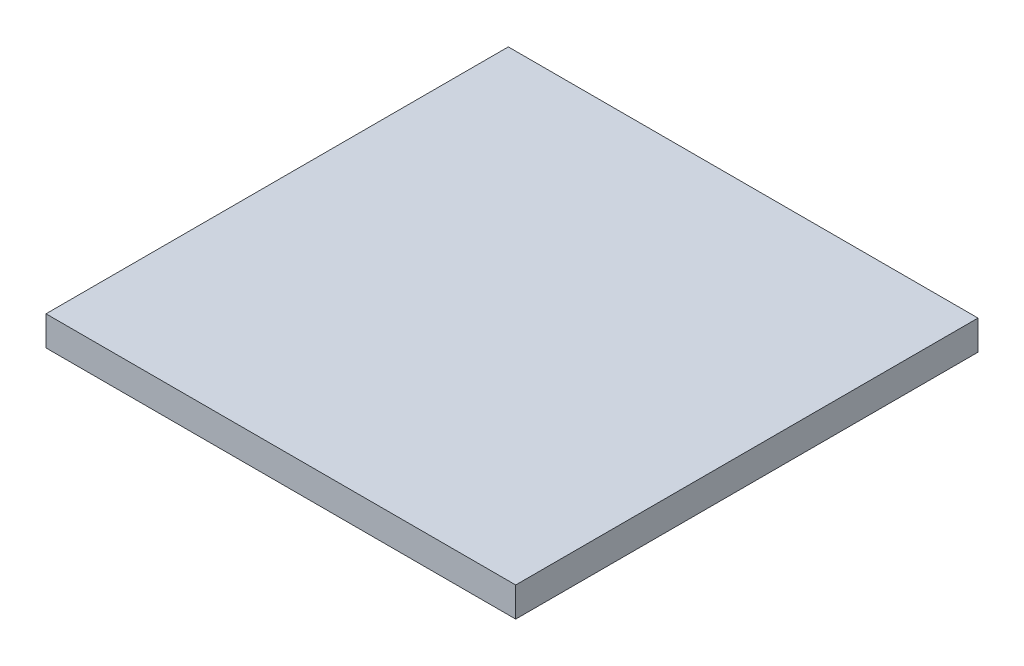
ISO-10303-21;
HEADER;
FILE_DESCRIPTION(('STEP AP214'),'2;1');
FILE_NAME('part.step','',(''),(''),'','','');
FILE_SCHEMA(('AUTOMOTIVE_DESIGN { 1 0 10303 214 1 1 1 1 }'));
ENDSEC;
DATA;
#1=APPLICATION_CONTEXT('core data for automotive mechanical design processes');
#2=APPLICATION_PROTOCOL_DEFINITION('international standard','automotive_design',2000,#1);
#3=PRODUCT_CONTEXT('',#1,'mechanical');
#4=PRODUCT('Part','Part','',(#3));
#5=PRODUCT_RELATED_PRODUCT_CATEGORY('part','',(#4));
#6=PRODUCT_DEFINITION_FORMATION('','',#4);
#7=PRODUCT_DEFINITION_CONTEXT('part definition',#1,'design');
#8=PRODUCT_DEFINITION('design','',#6,#7);
#9=PRODUCT_DEFINITION_SHAPE('','',#8);
#10=(LENGTH_UNIT() NAMED_UNIT(*) SI_UNIT(.MILLI.,.METRE.));
#11=(NAMED_UNIT(*) PLANE_ANGLE_UNIT() SI_UNIT($,.RADIAN.));
#12=(NAMED_UNIT(*) SI_UNIT($,.STERADIAN.) SOLID_ANGLE_UNIT());
#13=UNCERTAINTY_MEASURE_WITH_UNIT(LENGTH_MEASURE(1.E-05),#10,'distance_accuracy_value','');
#14=(GEOMETRIC_REPRESENTATION_CONTEXT(3) GLOBAL_UNCERTAINTY_ASSIGNED_CONTEXT((#13)) GLOBAL_UNIT_ASSIGNED_CONTEXT((#10,
#11,#12)) REPRESENTATION_CONTEXT('',''));
#15=CARTESIAN_POINT('',(0.,0.,0.));
#16=DIRECTION('',(0.,0.,1.));
#17=DIRECTION('',(1.,0.,0.));
#18=AXIS2_PLACEMENT_3D('',#15,#16,#17);
#19=CARTESIAN_POINT('',(0.,0.,100.));
#20=DIRECTION('',(1.,0.,0.));
#21=DIRECTION('',(0.,0.,-1.));
#22=AXIS2_PLACEMENT_3D('',#19,#20,#21);
#23=PLANE('',#22);
#24=DIRECTION('',(0.,-1.,0.));
#25=VECTOR('',#24,1.);
#26=CARTESIAN_POINT('',(0.,0.,0.));
#27=LINE('',#26,#25);
#28=CARTESIAN_POINT('',(0.,6.4,0.));
#29=VERTEX_POINT('',#28);
#30=CARTESIAN_POINT('',(0.,0.,0.));
#31=VERTEX_POINT('',#30);
#32=EDGE_CURVE('E109',#29,#31,#27,.T.);
#33=ORIENTED_EDGE('',*,*,#32,.T.);
#34=DIRECTION('',(0.,0.,-1.));
#35=VECTOR('',#34,1.);
#36=CARTESIAN_POINT('',(0.,0.,100.));
#37=LINE('',#36,#35);
#38=CARTESIAN_POINT('',(0.,0.,100.));
#39=VERTEX_POINT('',#38);
#40=EDGE_CURVE('E11',#39,#31,#37,.T.);
#41=ORIENTED_EDGE('',*,*,#40,.F.);
#42=DIRECTION('',(0.,-1.,0.));
#43=VECTOR('',#42,1.);
#44=CARTESIAN_POINT('',(0.,0.,100.));
#45=LINE('',#44,#43);
#46=CARTESIAN_POINT('',(0.,6.4,100.));
#47=VERTEX_POINT('',#46);
#48=EDGE_CURVE('E93',#47,#39,#45,.T.);
#49=ORIENTED_EDGE('',*,*,#48,.F.);
#50=DIRECTION('',(0.,0.,-1.));
#51=VECTOR('',#50,1.);
#52=CARTESIAN_POINT('',(0.,6.4,100.));
#53=LINE('',#52,#51);
#54=EDGE_CURVE('E105',#47,#29,#53,.T.);
#55=ORIENTED_EDGE('',*,*,#54,.T.);
#56=EDGE_LOOP('',(#33,#41,#49,#55));
#57=FACE_BOUND('',#56,.T.);
#58=ADVANCED_FACE('F41',(#57),#23,.F.);
#59=CARTESIAN_POINT('',(0.,0.,100.));
#60=DIRECTION('',(0.,1.,0.));
#61=DIRECTION('',(0.,0.,1.));
#62=AXIS2_PLACEMENT_3D('',#59,#60,#61);
#63=PLANE('',#62);
#64=DIRECTION('',(1.,0.,0.));
#65=VECTOR('',#64,1.);
#66=CARTESIAN_POINT('',(0.,0.,0.));
#67=LINE('',#66,#65);
#68=CARTESIAN_POINT('',(101.6,0.,0.));
#69=VERTEX_POINT('',#68);
#70=EDGE_CURVE('E98',#31,#69,#67,.T.);
#71=ORIENTED_EDGE('',*,*,#70,.T.);
#72=DIRECTION('',(0.,0.,-1.));
#73=VECTOR('',#72,1.);
#74=CARTESIAN_POINT('',(101.6,0.,100.));
#75=LINE('',#74,#73);
#76=CARTESIAN_POINT('',(101.6,0.,100.));
#77=VERTEX_POINT('',#76);
#78=EDGE_CURVE('E50',#77,#69,#75,.T.);
#79=ORIENTED_EDGE('',*,*,#78,.F.);
#80=DIRECTION('',(1.,0.,0.));
#81=VECTOR('',#80,1.);
#82=CARTESIAN_POINT('',(0.,0.,100.));
#83=LINE('',#82,#81);
#84=EDGE_CURVE('E88',#39,#77,#83,.T.);
#85=ORIENTED_EDGE('',*,*,#84,.F.);
#86=ORIENTED_EDGE('',*,*,#40,.T.);
#87=EDGE_LOOP('',(#71,#79,#85,#86));
#88=FACE_BOUND('',#87,.T.);
#89=ADVANCED_FACE('F97',(#88),#63,.F.);
#90=CARTESIAN_POINT('',(101.6,0.,100.));
#91=DIRECTION('',(-1.,0.,0.));
#92=DIRECTION('',(0.,0.,1.));
#93=AXIS2_PLACEMENT_3D('',#90,#91,#92);
#94=PLANE('',#93);
#95=DIRECTION('',(0.,1.,0.));
#96=VECTOR('',#95,1.);
#97=CARTESIAN_POINT('',(101.6,0.,0.));
#98=LINE('',#97,#96);
#99=CARTESIAN_POINT('',(101.6,6.4,0.));
#100=VERTEX_POINT('',#99);
#101=EDGE_CURVE('E75',#69,#100,#98,.T.);
#102=ORIENTED_EDGE('',*,*,#101,.T.);
#103=DIRECTION('',(0.,0.,-1.));
#104=VECTOR('',#103,1.);
#105=CARTESIAN_POINT('',(101.6,6.4,100.));
#106=LINE('',#105,#104);
#107=CARTESIAN_POINT('',(101.6,6.4,100.));
#108=VERTEX_POINT('',#107);
#109=EDGE_CURVE('E100',#108,#100,#106,.T.);
#110=ORIENTED_EDGE('',*,*,#109,.F.);
#111=DIRECTION('',(0.,1.,0.));
#112=VECTOR('',#111,1.);
#113=CARTESIAN_POINT('',(101.6,0.,100.));
#114=LINE('',#113,#112);
#115=EDGE_CURVE('E91',#77,#108,#114,.T.);
#116=ORIENTED_EDGE('',*,*,#115,.F.);
#117=ORIENTED_EDGE('',*,*,#78,.T.);
#118=EDGE_LOOP('',(#102,#110,#116,#117));
#119=FACE_BOUND('',#118,.T.);
#120=ADVANCED_FACE('F101',(#119),#94,.F.);
#121=CARTESIAN_POINT('',(0.,6.4,100.));
#122=DIRECTION('',(0.,-1.,0.));
#123=DIRECTION('',(0.,0.,-1.));
#124=AXIS2_PLACEMENT_3D('',#121,#122,#123);
#125=PLANE('',#124);
#126=DIRECTION('',(-1.,0.,0.));
#127=VECTOR('',#126,1.);
#128=CARTESIAN_POINT('',(0.,6.4,0.));
#129=LINE('',#128,#127);
#130=EDGE_CURVE('E81',#100,#29,#129,.T.);
#131=ORIENTED_EDGE('',*,*,#130,.T.);
#132=ORIENTED_EDGE('',*,*,#54,.F.);
#133=DIRECTION('',(-1.,0.,0.));
#134=VECTOR('',#133,1.);
#135=CARTESIAN_POINT('',(0.,6.4,100.));
#136=LINE('',#135,#134);
#137=EDGE_CURVE('E58',#108,#47,#136,.T.);
#138=ORIENTED_EDGE('',*,*,#137,.F.);
#139=ORIENTED_EDGE('',*,*,#109,.T.);
#140=EDGE_LOOP('',(#131,#132,#138,#139));
#141=FACE_BOUND('',#140,.T.);
#142=ADVANCED_FACE('F122',(#141),#125,.F.);
#143=CARTESIAN_POINT('',(0.,0.,100.));
#144=DIRECTION('',(0.,0.,-1.));
#145=DIRECTION('',(-1.,0.,0.));
#146=AXIS2_PLACEMENT_3D('',#143,#144,#145);
#147=PLANE('',#146);
#148=ORIENTED_EDGE('',*,*,#48,.T.);
#149=ORIENTED_EDGE('',*,*,#84,.T.);
#150=ORIENTED_EDGE('',*,*,#115,.T.);
#151=ORIENTED_EDGE('',*,*,#137,.T.);
#152=EDGE_LOOP('',(#148,#149,#150,#151));
#153=FACE_BOUND('',#152,.T.);
#154=ADVANCED_FACE('F89',(#153),#147,.F.);
#155=CARTESIAN_POINT('',(0.,0.,0.));
#156=DIRECTION('',(0.,0.,-1.));
#157=DIRECTION('',(-1.,0.,0.));
#158=AXIS2_PLACEMENT_3D('',#155,#156,#157);
#159=PLANE('',#158);
#160=ORIENTED_EDGE('',*,*,#32,.F.);
#161=ORIENTED_EDGE('',*,*,#130,.F.);
#162=ORIENTED_EDGE('',*,*,#101,.F.);
#163=ORIENTED_EDGE('',*,*,#70,.F.);
#164=EDGE_LOOP('',(#160,#161,#162,#163));
#165=FACE_BOUND('',#164,.T.);
#166=ADVANCED_FACE('F125',(#165),#159,.T.);
#167=CLOSED_SHELL('',(#58,#89,#120,#142,#154,#166));
#168=MANIFOLD_SOLID_BREP('B2',#167);
#169=ADVANCED_BREP_SHAPE_REPRESENTATION('',(#18,#168),#14);
#170=SHAPE_DEFINITION_REPRESENTATION(#9,#169);
ENDSEC;
END-ISO-10303-21;
